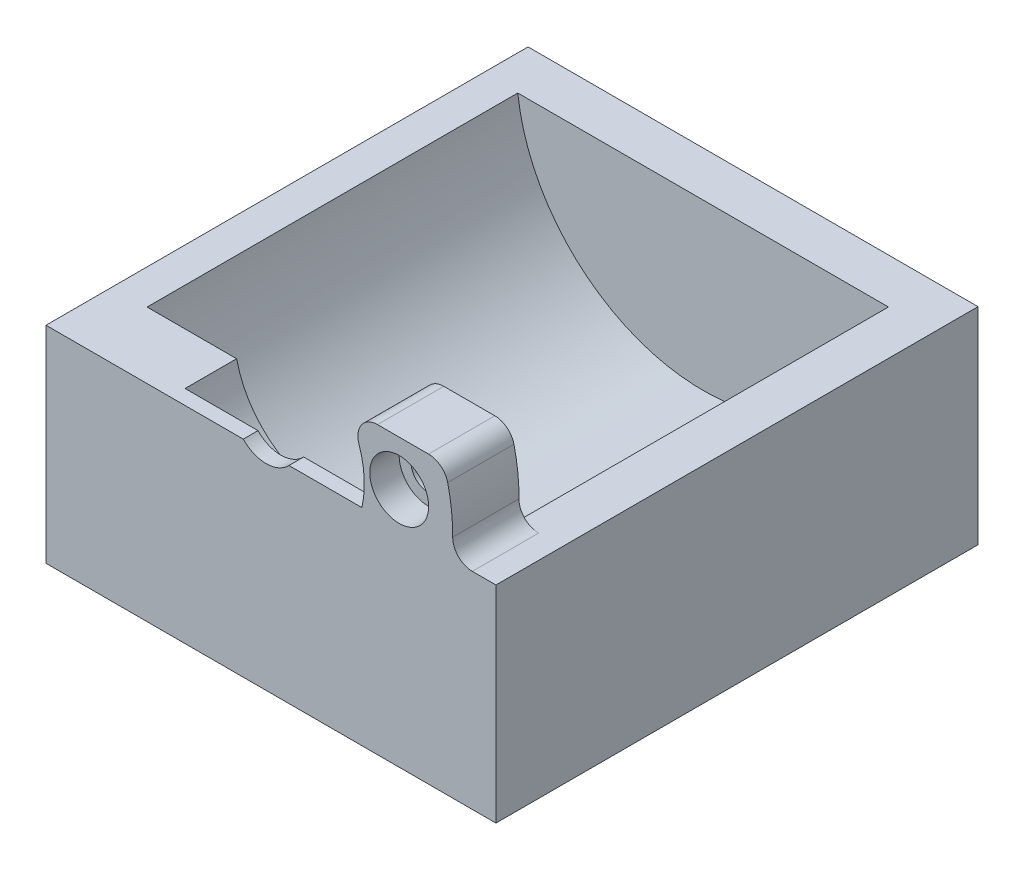
ISO-10303-21;
HEADER;
FILE_DESCRIPTION(('STEP AP214'),'2;1');
FILE_NAME('part.step','',(''),(''),'','','');
FILE_SCHEMA(('AUTOMOTIVE_DESIGN { 1 0 10303 214 1 1 1 1 }'));
ENDSEC;
DATA;
#1=APPLICATION_CONTEXT('core data for automotive mechanical design processes');
#2=APPLICATION_PROTOCOL_DEFINITION('international standard','automotive_design',2000,#1);
#3=PRODUCT_CONTEXT('',#1,'mechanical');
#4=PRODUCT('Part','Part','',(#3));
#5=PRODUCT_RELATED_PRODUCT_CATEGORY('part','',(#4));
#6=PRODUCT_DEFINITION_FORMATION('','',#4);
#7=PRODUCT_DEFINITION_CONTEXT('part definition',#1,'design');
#8=PRODUCT_DEFINITION('design','',#6,#7);
#9=PRODUCT_DEFINITION_SHAPE('','',#8);
#10=(LENGTH_UNIT() NAMED_UNIT(*) SI_UNIT(.MILLI.,.METRE.));
#11=(NAMED_UNIT(*) PLANE_ANGLE_UNIT() SI_UNIT($,.RADIAN.));
#12=(NAMED_UNIT(*) SI_UNIT($,.STERADIAN.) SOLID_ANGLE_UNIT());
#13=UNCERTAINTY_MEASURE_WITH_UNIT(LENGTH_MEASURE(1.E-05),#10,'distance_accuracy_value','');
#14=(GEOMETRIC_REPRESENTATION_CONTEXT(3) GLOBAL_UNCERTAINTY_ASSIGNED_CONTEXT((#13)) GLOBAL_UNIT_ASSIGNED_CONTEXT((#10,
#11,#12)) REPRESENTATION_CONTEXT('',''));
#15=CARTESIAN_POINT('',(0.,0.,0.));
#16=DIRECTION('',(0.,0.,1.));
#17=DIRECTION('',(1.,0.,0.));
#18=AXIS2_PLACEMENT_3D('',#15,#16,#17);
#19=CARTESIAN_POINT('',(-10.,0.,80.));
#20=DIRECTION('',(0.,0.,1.));
#21=DIRECTION('',(1.,0.,0.));
#22=AXIS2_PLACEMENT_3D('',#19,#20,#21);
#23=PLANE('',#22);
#24=DIRECTION('',(0.,-1.,0.));
#25=VECTOR('',#24,1.);
#26=CARTESIAN_POINT('',(69.7037540720334,60.4384133611691,80.));
#27=LINE('',#26,#25);
#28=CARTESIAN_POINT('',(69.7037540720334,10.4384133611691,80.));
#29=VERTEX_POINT('',#28);
#30=CARTESIAN_POINT('',(69.7037540720334,-10.5615866388309,80.));
#31=VERTEX_POINT('',#30);
#32=EDGE_CURVE('E206',#29,#31,#27,.T.);
#33=ORIENTED_EDGE('',*,*,#32,.T.);
#34=DIRECTION('',(-1.,0.,0.));
#35=VECTOR('',#34,1.);
#36=CARTESIAN_POINT('',(115.522386605031,-10.5615866388309,80.));
#37=LINE('',#36,#35);
#38=CARTESIAN_POINT('',(115.522386605031,-10.5615866388309,80.));
#39=VERTEX_POINT('',#38);
#40=EDGE_CURVE('E183',#39,#31,#37,.T.);
#41=ORIENTED_EDGE('',*,*,#40,.F.);
#42=DIRECTION('',(0.,-1.,0.));
#43=VECTOR('',#42,1.);
#44=CARTESIAN_POINT('',(115.522386605031,60.4384133611691,80.));
#45=LINE('',#44,#43);
#46=CARTESIAN_POINT('',(115.522386605031,10.4384133611691,80.));
#47=VERTEX_POINT('',#46);
#48=EDGE_CURVE('E203',#47,#39,#45,.T.);
#49=ORIENTED_EDGE('',*,*,#48,.F.);
#50=DIRECTION('',(-1.,0.,0.));
#51=VECTOR('',#50,1.);
#52=CARTESIAN_POINT('',(-92.8810020876827,10.4384133611691,80.));
#53=LINE('',#52,#51);
#54=CARTESIAN_POINT('',(113.118045509768,10.4384133611691,80.));
#55=VERTEX_POINT('',#54);
#56=EDGE_CURVE('E285',#47,#55,#53,.T.);
#57=ORIENTED_EDGE('',*,*,#56,.T.);
#58=CARTESIAN_POINT('',(113.118045509768,12.4384133611691,80.));
#59=DIRECTION('',(0.,0.,1.));
#60=DIRECTION('',(1.,0.,0.));
#61=AXIS2_PLACEMENT_3D('',#58,#59,#60);
#62=CIRCLE('',#61,2.);
#63=CARTESIAN_POINT('',(111.118136214773,12.4574609802167,80.));
#64=VERTEX_POINT('',#63);
#65=EDGE_CURVE('E329',#55,#64,#62,.F.);
#66=ORIENTED_EDGE('',*,*,#65,.T.);
#67=CARTESIAN_POINT('',(92.1189979123148,12.6384133611689,80.));
#68=DIRECTION('',(0.,0.,1.));
#69=DIRECTION('',(-1.,0.,0.));
#70=AXIS2_PLACEMENT_3D('',#67,#68,#69);
#71=CIRCLE('',#70,19.0000000000024);
#72=CARTESIAN_POINT('',(110.608046564802,17.0150650409405,80.));
#73=VERTEX_POINT('',#72);
#74=EDGE_CURVE('E227',#64,#73,#71,.T.);
#75=ORIENTED_EDGE('',*,*,#74,.T.);
#76=CARTESIAN_POINT('',(108.661830917172,16.5543648641225,80.));
#77=DIRECTION('',(0.,0.,1.));
#78=DIRECTION('',(1.,0.,0.));
#79=AXIS2_PLACEMENT_3D('',#76,#77,#78);
#80=CIRCLE('',#79,2.);
#81=CARTESIAN_POINT('',(108.661830917172,18.5543648641225,80.));
#82=VERTEX_POINT('',#81);
#83=EDGE_CURVE('E301',#73,#82,#80,.T.);
#84=ORIENTED_EDGE('',*,*,#83,.T.);
#85=DIRECTION('',(-1.,0.,0.));
#86=VECTOR('',#85,1.);
#87=CARTESIAN_POINT('',(100.181349790938,18.5543648641225,80.));
#88=LINE('',#87,#86);
#89=CARTESIAN_POINT('',(103.462071738513,18.5543648641225,80.));
#90=VERTEX_POINT('',#89);
#91=EDGE_CURVE('E223',#82,#90,#88,.T.);
#92=ORIENTED_EDGE('',*,*,#91,.T.);
#93=CARTESIAN_POINT('',(103.462071738513,16.5543648641225,80.));
#94=DIRECTION('',(0.,0.,1.));
#95=DIRECTION('',(1.,0.,0.));
#96=AXIS2_PLACEMENT_3D('',#93,#94,#95);
#97=CIRCLE('',#96,2.);
#98=CARTESIAN_POINT('',(101.571559434147,15.9017062802969,80.));
#99=VERTEX_POINT('',#98);
#100=EDGE_CURVE('E304',#90,#99,#97,.T.);
#101=ORIENTED_EDGE('',*,*,#100,.T.);
#102=CARTESIAN_POINT('',(92.1189979123168,12.638413361169,80.));
#103=DIRECTION('',(0.,0.,-1.));
#104=DIRECTION('',(-1.,0.,0.));
#105=AXIS2_PLACEMENT_3D('',#102,#103,#104);
#106=CIRCLE('',#105,10.0000000000004);
#107=CARTESIAN_POINT('',(101.873996630923,10.4384133611691,80.));
#108=VERTEX_POINT('',#107);
#109=EDGE_CURVE('E232',#99,#108,#106,.T.);
#110=ORIENTED_EDGE('',*,*,#109,.T.);
#111=CARTESIAN_POINT('',(94.4427879200417,10.4384133611691,80.));
#112=VERTEX_POINT('',#111);
#113=EDGE_CURVE('E289',#108,#112,#53,.T.);
#114=ORIENTED_EDGE('',*,*,#113,.T.);
#115=CARTESIAN_POINT('',(92.1189979123173,12.6384133611691,80.));
#116=DIRECTION('',(0.,0.,1.));
#117=DIRECTION('',(1.,0.,0.));
#118=AXIS2_PLACEMENT_3D('',#115,#116,#117);
#119=CIRCLE('',#118,3.2);
#120=CARTESIAN_POINT('',(89.7952079045928,10.4384133611691,80.));
#121=VERTEX_POINT('',#120);
#122=EDGE_CURVE('E248',#121,#112,#119,.T.);
#123=ORIENTED_EDGE('',*,*,#122,.F.);
#124=EDGE_CURVE('E284',#121,#29,#53,.T.);
#125=ORIENTED_EDGE('',*,*,#124,.T.);
#126=EDGE_LOOP('',(#33,#41,#49,#57,#66,#75,#84,#92,#101,#110,#114,#123,#125));
#127=FACE_BOUND('',#126,.T.);
#128=CARTESIAN_POINT('',(105.669337757458,13.9384133611691,80.));
#129=DIRECTION('',(0.,0.,1.));
#130=DIRECTION('',(1.,0.,0.));
#131=AXIS2_PLACEMENT_3D('',#128,#129,#130);
#132=CIRCLE('',#131,3.00000000000001);
#133=CARTESIAN_POINT('',(108.669337757458,13.9384133611691,80.));
#134=VERTEX_POINT('',#133);
#135=EDGE_CURVE('E210',#134,#134,#132,.T.);
#136=ORIENTED_EDGE('',*,*,#135,.F.);
#137=EDGE_LOOP('',(#136));
#138=FACE_BOUND('',#137,.T.);
#139=ADVANCED_FACE('F51',(#127,#138),#23,.T.);
#140=CARTESIAN_POINT('',(-92.8810020876827,10.4384133611691,80.));
#141=DIRECTION('',(0.,-1.,0.));
#142=DIRECTION('',(0.,0.,-1.));
#143=AXIS2_PLACEMENT_3D('',#140,#141,#142);
#144=PLANE('',#143);
#145=DIRECTION('',(-1.,0.,0.));
#146=VECTOR('',#145,1.);
#147=CARTESIAN_POINT('',(73.2467961329805,10.4384133611691,35.5));
#148=LINE('',#147,#146);
#149=CARTESIAN_POINT('',(110.991199691654,10.4384133611691,35.5));
#150=VERTEX_POINT('',#149);
#151=CARTESIAN_POINT('',(73.2467961329805,10.4384133611691,35.5));
#152=VERTEX_POINT('',#151);
#153=EDGE_CURVE('E345',#150,#152,#148,.T.);
#154=ORIENTED_EDGE('',*,*,#153,.F.);
#155=DIRECTION('',(0.,0.,1.));
#156=VECTOR('',#155,1.);
#157=CARTESIAN_POINT('',(110.991199691654,10.4384133611691,38.5));
#158=LINE('',#157,#156);
#159=CARTESIAN_POINT('',(110.991199691654,10.4384133611691,73.25));
#160=VERTEX_POINT('',#159);
#161=EDGE_CURVE('E281',#150,#160,#158,.T.);
#162=ORIENTED_EDGE('',*,*,#161,.T.);
#163=DIRECTION('',(1.,0.,0.));
#164=VECTOR('',#163,1.);
#165=CARTESIAN_POINT('',(92.1189979123173,10.4384133611691,73.25));
#166=LINE('',#165,#164);
#167=CARTESIAN_POINT('',(113.118045509768,10.4384133611691,73.25));
#168=VERTEX_POINT('',#167);
#169=EDGE_CURVE('E67',#160,#168,#166,.T.);
#170=ORIENTED_EDGE('',*,*,#169,.T.);
#171=DIRECTION('',(0.,0.,1.));
#172=VECTOR('',#171,1.);
#173=CARTESIAN_POINT('',(113.118045509768,10.4384133611691,80.));
#174=LINE('',#173,#172);
#175=EDGE_CURVE('E318',#168,#55,#174,.T.);
#176=ORIENTED_EDGE('',*,*,#175,.T.);
#177=ORIENTED_EDGE('',*,*,#56,.F.);
#178=DIRECTION('',(0.,0.,-1.));
#179=VECTOR('',#178,1.);
#180=CARTESIAN_POINT('',(115.522386605031,10.4384133611691,80.));
#181=LINE('',#180,#179);
#182=CARTESIAN_POINT('',(115.522386605031,10.4384133611691,30.9091006022906));
#183=VERTEX_POINT('',#182);
#184=EDGE_CURVE('E60',#47,#183,#181,.T.);
#185=ORIENTED_EDGE('',*,*,#184,.T.);
#186=DIRECTION('',(1.,0.,0.));
#187=VECTOR('',#186,1.);
#188=CARTESIAN_POINT('',(69.7037540720334,10.4384133611691,30.9091006022906));
#189=LINE('',#188,#187);
#190=CARTESIAN_POINT('',(69.7037540720334,10.4384133611691,30.9091006022906));
#191=VERTEX_POINT('',#190);
#192=EDGE_CURVE('E195',#191,#183,#189,.T.);
#193=ORIENTED_EDGE('',*,*,#192,.F.);
#194=DIRECTION('',(0.,0.,-1.));
#195=VECTOR('',#194,1.);
#196=CARTESIAN_POINT('',(69.7037540720334,10.4384133611691,80.));
#197=LINE('',#196,#195);
#198=EDGE_CURVE('E11',#29,#191,#197,.T.);
#199=ORIENTED_EDGE('',*,*,#198,.F.);
#200=ORIENTED_EDGE('',*,*,#124,.F.);
#201=DIRECTION('',(0.,0.,-1.));
#202=VECTOR('',#201,1.);
#203=CARTESIAN_POINT('',(89.7952079045928,10.4384133611691,118.5));
#204=LINE('',#203,#202);
#205=CARTESIAN_POINT('',(89.7952079045928,10.4384133611691,78.5));
#206=VERTEX_POINT('',#205);
#207=EDGE_CURVE('E256',#121,#206,#204,.T.);
#208=ORIENTED_EDGE('',*,*,#207,.T.);
#209=DIRECTION('',(1.,0.,0.));
#210=VECTOR('',#209,1.);
#211=CARTESIAN_POINT('',(-92.8810020876827,10.4384133611691,78.5));
#212=LINE('',#211,#210);
#213=CARTESIAN_POINT('',(82.3639991937115,10.4384133611691,78.5));
#214=VERTEX_POINT('',#213);
#215=EDGE_CURVE('E290',#214,#206,#212,.T.);
#216=ORIENTED_EDGE('',*,*,#215,.F.);
#217=DIRECTION('',(0.,0.,-1.));
#218=VECTOR('',#217,1.);
#219=CARTESIAN_POINT('',(82.3639991937115,10.4384133611691,78.5));
#220=LINE('',#219,#218);
#221=CARTESIAN_POINT('',(82.3639991937115,10.4384133611691,73.25));
#222=VERTEX_POINT('',#221);
#223=EDGE_CURVE('E265',#214,#222,#220,.T.);
#224=ORIENTED_EDGE('',*,*,#223,.T.);
#225=DIRECTION('',(-1.,0.,0.));
#226=VECTOR('',#225,1.);
#227=CARTESIAN_POINT('',(73.2467961329805,10.4384133611691,73.25));
#228=LINE('',#227,#226);
#229=CARTESIAN_POINT('',(73.2467961329805,10.4384133611691,73.25));
#230=VERTEX_POINT('',#229);
#231=EDGE_CURVE('E271',#222,#230,#228,.T.);
#232=ORIENTED_EDGE('',*,*,#231,.T.);
#233=DIRECTION('',(0.,0.,1.));
#234=VECTOR('',#233,1.);
#235=CARTESIAN_POINT('',(73.2467961329805,10.4384133611691,38.5));
#236=LINE('',#235,#234);
#237=EDGE_CURVE('E278',#230,#152,#236,.F.);
#238=ORIENTED_EDGE('',*,*,#237,.T.);
#239=EDGE_LOOP('',(#154,#162,#170,#176,#177,#185,#193,#199,#200,#208,#216,#224,#232,#238));
#240=FACE_BOUND('',#239,.T.);
#241=ADVANCED_FACE('F340',(#240),#144,.F.);
#242=CARTESIAN_POINT('',(105.669337757458,13.9384133611691,73.25));
#243=DIRECTION('',(0.,0.,1.));
#244=DIRECTION('',(1.,0.,0.));
#245=AXIS2_PLACEMENT_3D('',#242,#243,#244);
#246=CYLINDRICAL_SURFACE('',#245,1.79999999999999);
#247=CARTESIAN_POINT('',(105.669337757458,13.9384133611691,73.25));
#248=DIRECTION('',(0.,0.,1.));
#249=DIRECTION('',(1.,0.,0.));
#250=AXIS2_PLACEMENT_3D('',#247,#248,#249);
#251=CIRCLE('',#250,1.79999999999999);
#252=CARTESIAN_POINT('',(107.469337757458,13.9384133611691,73.25));
#253=VERTEX_POINT('',#252);
#254=EDGE_CURVE('E235',#253,#253,#251,.T.);
#255=ORIENTED_EDGE('',*,*,#254,.F.);
#256=EDGE_LOOP('',(#255));
#257=FACE_BOUND('',#256,.T.);
#258=CARTESIAN_POINT('',(105.669337757458,13.9384133611691,77.));
#259=DIRECTION('',(0.,0.,1.));
#260=DIRECTION('',(1.,0.,0.));
#261=AXIS2_PLACEMENT_3D('',#258,#259,#260);
#262=CIRCLE('',#261,1.79999999999999);
#263=CARTESIAN_POINT('',(107.469337757458,13.9384133611691,77.));
#264=VERTEX_POINT('',#263);
#265=EDGE_CURVE('E214',#264,#264,#262,.F.);
#266=ORIENTED_EDGE('',*,*,#265,.F.);
#267=EDGE_LOOP('',(#266));
#268=FACE_BOUND('',#267,.T.);
#269=ADVANCED_FACE('F419',(#257,#268),#246,.F.);
#270=CARTESIAN_POINT('',(92.1189979123173,12.6384133611691,38.5));
#271=DIRECTION('',(0.,0.,1.));
#272=DIRECTION('',(1.,0.,0.));
#273=AXIS2_PLACEMENT_3D('',#270,#271,#272);
#274=CYLINDRICAL_SURFACE('',#273,19.);
#275=CARTESIAN_POINT('',(92.1189979123173,12.6384133611691,73.25));
#276=DIRECTION('',(0.,0.,1.));
#277=DIRECTION('',(1.,0.,0.));
#278=AXIS2_PLACEMENT_3D('',#275,#276,#277);
#279=CIRCLE('',#278,19.);
#280=EDGE_CURVE('E274',#230,#160,#279,.T.);
#281=ORIENTED_EDGE('',*,*,#280,.T.);
#282=ORIENTED_EDGE('',*,*,#161,.F.);
#283=CARTESIAN_POINT('',(92.1189979123173,12.6384133611691,35.5));
#284=DIRECTION('',(0.,0.,1.));
#285=DIRECTION('',(1.,0.,0.));
#286=AXIS2_PLACEMENT_3D('',#283,#284,#285);
#287=CIRCLE('',#286,19.);
#288=EDGE_CURVE('E185',#152,#150,#287,.T.);
#289=ORIENTED_EDGE('',*,*,#288,.F.);
#290=ORIENTED_EDGE('',*,*,#237,.F.);
#291=EDGE_LOOP('',(#281,#282,#289,#290));
#292=FACE_BOUND('',#291,.T.);
#293=ADVANCED_FACE('F424',(#292),#274,.F.);
#294=CARTESIAN_POINT('',(92.1189979123173,12.6384133611691,73.25));
#295=DIRECTION('',(0.,0.,1.));
#296=DIRECTION('',(1.,0.,0.));
#297=AXIS2_PLACEMENT_3D('',#294,#295,#296);
#298=PLANE('',#297);
#299=CARTESIAN_POINT('',(92.1189979123173,12.6384133611691,73.25));
#300=DIRECTION('',(0.,0.,-1.));
#301=DIRECTION('',(-1.,0.,0.));
#302=AXIS2_PLACEMENT_3D('',#299,#300,#301);
#303=CIRCLE('',#302,9.99999999999999);
#304=CARTESIAN_POINT('',(101.571559434147,15.901706280297,73.25));
#305=VERTEX_POINT('',#304);
#306=EDGE_CURVE('E260',#305,#222,#303,.T.);
#307=ORIENTED_EDGE('',*,*,#306,.F.);
#308=CARTESIAN_POINT('',(103.462071738513,16.5543648641225,73.25));
#309=DIRECTION('',(0.,0.,1.));
#310=DIRECTION('',(1.,0.,0.));
#311=AXIS2_PLACEMENT_3D('',#308,#309,#310);
#312=CIRCLE('',#311,2.);
#313=CARTESIAN_POINT('',(103.462071738513,18.5543648641225,73.25));
#314=VERTEX_POINT('',#313);
#315=EDGE_CURVE('E313',#305,#314,#312,.F.);
#316=ORIENTED_EDGE('',*,*,#315,.T.);
#317=DIRECTION('',(-1.,0.,0.));
#318=VECTOR('',#317,1.);
#319=CARTESIAN_POINT('',(100.181349790938,18.5543648641225,73.25));
#320=LINE('',#319,#318);
#321=CARTESIAN_POINT('',(108.661830917172,18.5543648641225,73.25));
#322=VERTEX_POINT('',#321);
#323=EDGE_CURVE('E222',#322,#314,#320,.T.);
#324=ORIENTED_EDGE('',*,*,#323,.F.);
#325=CARTESIAN_POINT('',(108.661830917172,16.5543648641225,73.25));
#326=DIRECTION('',(0.,0.,1.));
#327=DIRECTION('',(1.,0.,0.));
#328=AXIS2_PLACEMENT_3D('',#325,#326,#327);
#329=CIRCLE('',#328,2.);
#330=CARTESIAN_POINT('',(110.608046564802,17.0150650409405,73.25));
#331=VERTEX_POINT('',#330);
#332=EDGE_CURVE('E310',#322,#331,#329,.F.);
#333=ORIENTED_EDGE('',*,*,#332,.T.);
#334=CARTESIAN_POINT('',(92.1189979123148,12.6384133611689,73.25));
#335=DIRECTION('',(0.,0.,1.));
#336=DIRECTION('',(-1.,0.,0.));
#337=AXIS2_PLACEMENT_3D('',#334,#335,#336);
#338=CIRCLE('',#337,19.0000000000024);
#339=CARTESIAN_POINT('',(111.118136214773,12.4574609802167,73.25));
#340=VERTEX_POINT('',#339);
#341=EDGE_CURVE('E228',#340,#331,#338,.T.);
#342=ORIENTED_EDGE('',*,*,#341,.F.);
#343=CARTESIAN_POINT('',(113.118045509768,12.4384133611691,73.25));
#344=DIRECTION('',(0.,0.,1.));
#345=DIRECTION('',(1.,0.,0.));
#346=AXIS2_PLACEMENT_3D('',#343,#344,#345);
#347=CIRCLE('',#346,2.);
#348=EDGE_CURVE('E72',#340,#168,#347,.T.);
#349=ORIENTED_EDGE('',*,*,#348,.T.);
#350=ORIENTED_EDGE('',*,*,#169,.F.);
#351=ORIENTED_EDGE('',*,*,#280,.F.);
#352=ORIENTED_EDGE('',*,*,#231,.F.);
#353=EDGE_LOOP('',(#307,#316,#324,#333,#342,#349,#350,#351,#352));
#354=FACE_BOUND('',#353,.T.);
#355=ORIENTED_EDGE('',*,*,#254,.T.);
#356=EDGE_LOOP('',(#355));
#357=FACE_BOUND('',#356,.T.);
#358=ADVANCED_FACE('F454',(#354,#357),#298,.F.);
#359=CARTESIAN_POINT('',(92.1189979123173,12.6384133611691,78.5));
#360=DIRECTION('',(0.,0.,-1.));
#361=DIRECTION('',(-1.,0.,0.));
#362=AXIS2_PLACEMENT_3D('',#359,#360,#361);
#363=PLANE('',#362);
#364=CARTESIAN_POINT('',(92.1189979123173,12.6384133611691,78.5));
#365=DIRECTION('',(0.,0.,-1.));
#366=DIRECTION('',(-1.,0.,0.));
#367=AXIS2_PLACEMENT_3D('',#364,#365,#366);
#368=CIRCLE('',#367,3.2);
#369=CARTESIAN_POINT('',(94.4427879200417,10.4384133611691,78.5));
#370=VERTEX_POINT('',#369);
#371=EDGE_CURVE('E245',#370,#206,#368,.T.);
#372=ORIENTED_EDGE('',*,*,#371,.F.);
#373=CARTESIAN_POINT('',(101.873996630923,10.4384133611691,78.5));
#374=VERTEX_POINT('',#373);
#375=EDGE_CURVE('E288',#370,#374,#212,.T.);
#376=ORIENTED_EDGE('',*,*,#375,.T.);
#377=CARTESIAN_POINT('',(92.1189979123173,12.6384133611691,78.5));
#378=DIRECTION('',(0.,0.,-1.));
#379=DIRECTION('',(-1.,0.,0.));
#380=AXIS2_PLACEMENT_3D('',#377,#378,#379);
#381=CIRCLE('',#380,9.99999999999999);
#382=EDGE_CURVE('E261',#374,#214,#381,.T.);
#383=ORIENTED_EDGE('',*,*,#382,.T.);
#384=ORIENTED_EDGE('',*,*,#215,.T.);
#385=EDGE_LOOP('',(#372,#376,#383,#384));
#386=FACE_BOUND('',#385,.T.);
#387=ADVANCED_FACE('F463',(#386),#363,.T.);
#388=CARTESIAN_POINT('',(92.1189979123173,12.6384133611691,118.5));
#389=DIRECTION('',(0.,0.,-1.));
#390=DIRECTION('',(-1.,0.,0.));
#391=AXIS2_PLACEMENT_3D('',#388,#389,#390);
#392=CYLINDRICAL_SURFACE('',#391,3.2);
#393=ORIENTED_EDGE('',*,*,#122,.T.);
#394=DIRECTION('',(0.,0.,-1.));
#395=VECTOR('',#394,1.);
#396=CARTESIAN_POINT('',(94.4427879200417,10.4384133611691,118.5));
#397=LINE('',#396,#395);
#398=EDGE_CURVE('E252',#370,#112,#397,.F.);
#399=ORIENTED_EDGE('',*,*,#398,.F.);
#400=ORIENTED_EDGE('',*,*,#371,.T.);
#401=ORIENTED_EDGE('',*,*,#207,.F.);
#402=EDGE_LOOP('',(#393,#399,#400,#401));
#403=FACE_BOUND('',#402,.T.);
#404=ADVANCED_FACE('F485',(#403),#392,.F.);
#405=ORIENTED_EDGE('',*,*,#113,.F.);
#406=DIRECTION('',(0.,0.,1.));
#407=VECTOR('',#406,1.);
#408=CARTESIAN_POINT('',(101.873996630923,10.4384133611691,73.25));
#409=LINE('',#408,#407);
#410=EDGE_CURVE('E218',#374,#108,#409,.T.);
#411=ORIENTED_EDGE('',*,*,#410,.F.);
#412=ORIENTED_EDGE('',*,*,#375,.F.);
#413=ORIENTED_EDGE('',*,*,#398,.T.);
#414=EDGE_LOOP('',(#405,#411,#412,#413));
#415=FACE_BOUND('',#414,.T.);
#416=ADVANCED_FACE('F421',(#415),#144,.F.);
#417=CARTESIAN_POINT('',(92.1189979123173,12.6384133611691,78.5));
#418=DIRECTION('',(0.,0.,-1.));
#419=DIRECTION('',(-1.,0.,0.));
#420=AXIS2_PLACEMENT_3D('',#417,#418,#419);
#421=CYLINDRICAL_SURFACE('',#420,9.99999999999999);
#422=ORIENTED_EDGE('',*,*,#109,.F.);
#423=DIRECTION('',(0.,0.,-1.));
#424=VECTOR('',#423,1.);
#425=CARTESIAN_POINT('',(101.571559434147,15.901706280297,78.5));
#426=LINE('',#425,#424);
#427=EDGE_CURVE('E307',#99,#305,#426,.T.);
#428=ORIENTED_EDGE('',*,*,#427,.T.);
#429=ORIENTED_EDGE('',*,*,#306,.T.);
#430=ORIENTED_EDGE('',*,*,#223,.F.);
#431=ORIENTED_EDGE('',*,*,#382,.F.);
#432=ORIENTED_EDGE('',*,*,#410,.T.);
#433=EDGE_LOOP('',(#422,#428,#429,#430,#431,#432));
#434=FACE_BOUND('',#433,.T.);
#435=ADVANCED_FACE('F430',(#434),#421,.F.);
#436=CARTESIAN_POINT('',(103.462071738513,16.5543648641225,78.5));
#437=DIRECTION('',(0.,0.,-1.));
#438=DIRECTION('',(-1.,0.,0.));
#439=AXIS2_PLACEMENT_3D('',#436,#437,#438);
#440=CYLINDRICAL_SURFACE('',#439,2.);
#441=ORIENTED_EDGE('',*,*,#315,.F.);
#442=ORIENTED_EDGE('',*,*,#427,.F.);
#443=ORIENTED_EDGE('',*,*,#100,.F.);
#444=DIRECTION('',(0.,0.,1.));
#445=VECTOR('',#444,1.);
#446=CARTESIAN_POINT('',(103.462071738513,18.5543648641225,80.));
#447=LINE('',#446,#445);
#448=EDGE_CURVE('E297',#314,#90,#447,.T.);
#449=ORIENTED_EDGE('',*,*,#448,.F.);
#450=EDGE_LOOP('',(#441,#442,#443,#449));
#451=FACE_BOUND('',#450,.T.);
#452=ADVANCED_FACE('F427',(#451),#440,.T.);
#453=CARTESIAN_POINT('',(100.181349790938,18.5543648641225,73.25));
#454=DIRECTION('',(0.,1.,0.));
#455=DIRECTION('',(0.,0.,1.));
#456=AXIS2_PLACEMENT_3D('',#453,#454,#455);
#457=PLANE('',#456);
#458=ORIENTED_EDGE('',*,*,#323,.T.);
#459=ORIENTED_EDGE('',*,*,#448,.T.);
#460=ORIENTED_EDGE('',*,*,#91,.F.);
#461=DIRECTION('',(0.,0.,1.));
#462=VECTOR('',#461,1.);
#463=CARTESIAN_POINT('',(108.661830917172,18.5543648641225,73.25));
#464=LINE('',#463,#462);
#465=EDGE_CURVE('E294',#82,#322,#464,.F.);
#466=ORIENTED_EDGE('',*,*,#465,.T.);
#467=EDGE_LOOP('',(#458,#459,#460,#466));
#468=FACE_BOUND('',#467,.T.);
#469=ADVANCED_FACE('F429',(#468),#457,.T.);
#470=CARTESIAN_POINT('',(108.661830917172,16.5543648641225,73.25));
#471=DIRECTION('',(0.,0.,1.));
#472=DIRECTION('',(1.,0.,0.));
#473=AXIS2_PLACEMENT_3D('',#470,#471,#472);
#474=CYLINDRICAL_SURFACE('',#473,2.);
#475=ORIENTED_EDGE('',*,*,#332,.F.);
#476=ORIENTED_EDGE('',*,*,#465,.F.);
#477=ORIENTED_EDGE('',*,*,#83,.F.);
#478=DIRECTION('',(0.,0.,1.));
#479=VECTOR('',#478,1.);
#480=CARTESIAN_POINT('',(110.608046564802,17.0150650409405,73.25));
#481=LINE('',#480,#479);
#482=EDGE_CURVE('E322',#331,#73,#481,.T.);
#483=ORIENTED_EDGE('',*,*,#482,.F.);
#484=EDGE_LOOP('',(#475,#476,#477,#483));
#485=FACE_BOUND('',#484,.T.);
#486=ADVANCED_FACE('F53',(#485),#474,.T.);
#487=CARTESIAN_POINT('',(92.1189979123148,12.6384133611689,73.25));
#488=DIRECTION('',(0.,0.,1.));
#489=DIRECTION('',(1.,0.,0.));
#490=AXIS2_PLACEMENT_3D('',#487,#488,#489);
#491=CYLINDRICAL_SURFACE('',#490,19.0000000000024);
#492=ORIENTED_EDGE('',*,*,#74,.F.);
#493=DIRECTION('',(0.,0.,1.));
#494=VECTOR('',#493,1.);
#495=CARTESIAN_POINT('',(111.118136214773,12.4574609802167,73.25));
#496=LINE('',#495,#494);
#497=EDGE_CURVE('E326',#64,#340,#496,.F.);
#498=ORIENTED_EDGE('',*,*,#497,.T.);
#499=ORIENTED_EDGE('',*,*,#341,.T.);
#500=ORIENTED_EDGE('',*,*,#482,.T.);
#501=EDGE_LOOP('',(#492,#498,#499,#500));
#502=FACE_BOUND('',#501,.T.);
#503=ADVANCED_FACE('F435',(#502),#491,.T.);
#504=CARTESIAN_POINT('',(113.118045509768,12.4384133611691,73.25));
#505=DIRECTION('',(0.,0.,1.));
#506=DIRECTION('',(1.,0.,0.));
#507=AXIS2_PLACEMENT_3D('',#504,#505,#506);
#508=CYLINDRICAL_SURFACE('',#507,2.);
#509=ORIENTED_EDGE('',*,*,#348,.F.);
#510=ORIENTED_EDGE('',*,*,#497,.F.);
#511=ORIENTED_EDGE('',*,*,#65,.F.);
#512=ORIENTED_EDGE('',*,*,#175,.F.);
#513=EDGE_LOOP('',(#509,#510,#511,#512));
#514=FACE_BOUND('',#513,.T.);
#515=ADVANCED_FACE('F432',(#514),#508,.F.);
#516=CARTESIAN_POINT('',(105.669337757458,13.9384133611691,77.));
#517=DIRECTION('',(0.,0.,1.));
#518=DIRECTION('',(1.,0.,0.));
#519=AXIS2_PLACEMENT_3D('',#516,#517,#518);
#520=PLANE('',#519);
#521=CARTESIAN_POINT('',(105.669337757458,13.9384133611691,77.));
#522=DIRECTION('',(0.,0.,1.));
#523=DIRECTION('',(1.,0.,0.));
#524=AXIS2_PLACEMENT_3D('',#521,#522,#523);
#525=CIRCLE('',#524,3.00000000000001);
#526=CARTESIAN_POINT('',(108.669337757458,13.9384133611691,77.));
#527=VERTEX_POINT('',#526);
#528=EDGE_CURVE('E209',#527,#527,#525,.T.);
#529=ORIENTED_EDGE('',*,*,#528,.T.);
#530=EDGE_LOOP('',(#529));
#531=FACE_BOUND('',#530,.T.);
#532=ORIENTED_EDGE('',*,*,#265,.T.);
#533=EDGE_LOOP('',(#532));
#534=FACE_BOUND('',#533,.T.);
#535=ADVANCED_FACE('F434',(#531,#534),#520,.T.);
#536=CARTESIAN_POINT('',(105.669337757458,13.9384133611691,77.));
#537=DIRECTION('',(0.,0.,1.));
#538=DIRECTION('',(1.,0.,0.));
#539=AXIS2_PLACEMENT_3D('',#536,#537,#538);
#540=CYLINDRICAL_SURFACE('',#539,3.00000000000001);
#541=ORIENTED_EDGE('',*,*,#528,.F.);
#542=EDGE_LOOP('',(#541));
#543=FACE_BOUND('',#542,.T.);
#544=ORIENTED_EDGE('',*,*,#135,.T.);
#545=EDGE_LOOP('',(#544));
#546=FACE_BOUND('',#545,.T.);
#547=ADVANCED_FACE('F441',(#543,#546),#540,.F.);
#548=CARTESIAN_POINT('',(69.7037540720334,60.4384133611691,0.));
#549=DIRECTION('',(-1.,0.,0.));
#550=DIRECTION('',(0.,0.,1.));
#551=AXIS2_PLACEMENT_3D('',#548,#549,#550);
#552=PLANE('',#551);
#553=DIRECTION('',(0.,1.,0.));
#554=VECTOR('',#553,1.);
#555=CARTESIAN_POINT('',(69.7037540720334,3.43841336116911,30.9091006022906));
#556=LINE('',#555,#554);
#557=CARTESIAN_POINT('',(69.7037540720334,-10.5615866388309,30.9091006022906));
#558=VERTEX_POINT('',#557);
#559=EDGE_CURVE('E164',#558,#191,#556,.T.);
#560=ORIENTED_EDGE('',*,*,#559,.F.);
#561=DIRECTION('',(0.,0.,1.));
#562=VECTOR('',#561,1.);
#563=CARTESIAN_POINT('',(69.7037540720334,-10.5615866388309,0.));
#564=LINE('',#563,#562);
#565=EDGE_CURVE('E167',#558,#31,#564,.T.);
#566=ORIENTED_EDGE('',*,*,#565,.T.);
#567=ORIENTED_EDGE('',*,*,#32,.F.);
#568=ORIENTED_EDGE('',*,*,#198,.T.);
#569=EDGE_LOOP('',(#560,#566,#567,#568));
#570=FACE_BOUND('',#569,.T.);
#571=ADVANCED_FACE('F166',(#570),#552,.T.);
#572=CARTESIAN_POINT('',(115.522386605031,60.4384133611691,0.));
#573=DIRECTION('',(-1.,0.,0.));
#574=DIRECTION('',(0.,0.,1.));
#575=AXIS2_PLACEMENT_3D('',#572,#573,#574);
#576=PLANE('',#575);
#577=DIRECTION('',(0.,0.,1.));
#578=VECTOR('',#577,1.);
#579=CARTESIAN_POINT('',(115.522386605031,-10.5615866388309,34.9091006022906));
#580=LINE('',#579,#578);
#581=CARTESIAN_POINT('',(115.522386605031,-10.5615866388309,30.9091006022906));
#582=VERTEX_POINT('',#581);
#583=EDGE_CURVE('E175',#582,#39,#580,.T.);
#584=ORIENTED_EDGE('',*,*,#583,.F.);
#585=DIRECTION('',(0.,-1.,0.));
#586=VECTOR('',#585,1.);
#587=CARTESIAN_POINT('',(115.522386605031,10.4384133611691,30.9091006022906));
#588=LINE('',#587,#586);
#589=EDGE_CURVE('E191',#183,#582,#588,.T.);
#590=ORIENTED_EDGE('',*,*,#589,.F.);
#591=ORIENTED_EDGE('',*,*,#184,.F.);
#592=ORIENTED_EDGE('',*,*,#48,.T.);
#593=EDGE_LOOP('',(#584,#590,#591,#592));
#594=FACE_BOUND('',#593,.T.);
#595=ADVANCED_FACE('F343',(#594),#576,.F.);
#596=CARTESIAN_POINT('',(0.,-10.5615866388309,0.));
#597=DIRECTION('',(0.,-1.,0.));
#598=DIRECTION('',(0.,0.,-1.));
#599=AXIS2_PLACEMENT_3D('',#596,#597,#598);
#600=PLANE('',#599);
#601=CARTESIAN_POINT('',(80.2137540720337,-10.5615866388309,43.05));
#602=DIRECTION('',(0.,-1.,0.));
#603=DIRECTION('',(0.,0.,-1.));
#604=AXIS2_PLACEMENT_3D('',#601,#602,#603);
#605=CIRCLE('',#604,3.15);
#606=CARTESIAN_POINT('',(80.2137540720337,-10.5615866388309,39.9));
#607=VERTEX_POINT('',#606);
#608=EDGE_CURVE('E373',#607,#607,#605,.T.);
#609=ORIENTED_EDGE('',*,*,#608,.F.);
#610=EDGE_LOOP('',(#609));
#611=FACE_BOUND('',#610,.T.);
#612=CARTESIAN_POINT('',(105.013754072034,-10.5615866388309,43.05));
#613=DIRECTION('',(0.,-1.,0.));
#614=DIRECTION('',(0.,0.,-1.));
#615=AXIS2_PLACEMENT_3D('',#612,#613,#614);
#616=CIRCLE('',#615,3.15);
#617=CARTESIAN_POINT('',(105.013754072034,-10.5615866388309,39.9));
#618=VERTEX_POINT('',#617);
#619=EDGE_CURVE('E365',#618,#618,#616,.T.);
#620=ORIENTED_EDGE('',*,*,#619,.F.);
#621=EDGE_LOOP('',(#620));
#622=FACE_BOUND('',#621,.T.);
#623=CARTESIAN_POINT('',(105.013754072033,-10.5615866388309,67.85));
#624=DIRECTION('',(0.,-1.,0.));
#625=DIRECTION('',(0.,0.,-1.));
#626=AXIS2_PLACEMENT_3D('',#623,#624,#625);
#627=CIRCLE('',#626,3.15);
#628=CARTESIAN_POINT('',(105.013754072033,-10.5615866388309,64.7));
#629=VERTEX_POINT('',#628);
#630=EDGE_CURVE('E357',#629,#629,#627,.T.);
#631=ORIENTED_EDGE('',*,*,#630,.F.);
#632=EDGE_LOOP('',(#631));
#633=FACE_BOUND('',#632,.T.);
#634=CARTESIAN_POINT('',(80.2137540720334,-10.5615866388309,67.85));
#635=DIRECTION('',(0.,-1.,0.));
#636=DIRECTION('',(0.,0.,-1.));
#637=AXIS2_PLACEMENT_3D('',#634,#635,#636);
#638=CIRCLE('',#637,3.15);
#639=CARTESIAN_POINT('',(80.2137540720334,-10.5615866388309,64.7));
#640=VERTEX_POINT('',#639);
#641=EDGE_CURVE('E353',#640,#640,#638,.T.);
#642=ORIENTED_EDGE('',*,*,#641,.F.);
#643=EDGE_LOOP('',(#642));
#644=FACE_BOUND('',#643,.T.);
#645=ORIENTED_EDGE('',*,*,#565,.F.);
#646=DIRECTION('',(-1.,0.,0.));
#647=VECTOR('',#646,1.);
#648=CARTESIAN_POINT('',(115.522386605031,-10.5615866388309,30.9091006022906));
#649=LINE('',#648,#647);
#650=EDGE_CURVE('E176',#582,#558,#649,.T.);
#651=ORIENTED_EDGE('',*,*,#650,.F.);
#652=ORIENTED_EDGE('',*,*,#583,.T.);
#653=ORIENTED_EDGE('',*,*,#40,.T.);
#654=EDGE_LOOP('',(#645,#651,#652,#653));
#655=FACE_BOUND('',#654,.T.);
#656=ADVANCED_FACE('F180',(#611,#622,#633,#644,#655),#600,.T.);
#657=CARTESIAN_POINT('',(0.,0.,30.9091006022906));
#658=DIRECTION('',(0.,0.,-1.));
#659=DIRECTION('',(-1.,0.,0.));
#660=AXIS2_PLACEMENT_3D('',#657,#658,#659);
#661=PLANE('',#660);
#662=ORIENTED_EDGE('',*,*,#650,.T.);
#663=ORIENTED_EDGE('',*,*,#559,.T.);
#664=ORIENTED_EDGE('',*,*,#192,.T.);
#665=ORIENTED_EDGE('',*,*,#589,.T.);
#666=EDGE_LOOP('',(#662,#663,#664,#665));
#667=FACE_BOUND('',#666,.T.);
#668=ADVANCED_FACE('F189',(#667),#661,.T.);
#669=CARTESIAN_POINT('',(92.1189979123173,12.6384133611691,35.5));
#670=DIRECTION('',(0.,0.,1.));
#671=DIRECTION('',(1.,0.,0.));
#672=AXIS2_PLACEMENT_3D('',#669,#670,#671);
#673=PLANE('',#672);
#674=ORIENTED_EDGE('',*,*,#288,.T.);
#675=ORIENTED_EDGE('',*,*,#153,.T.);
#676=EDGE_LOOP('',(#674,#675));
#677=FACE_BOUND('',#676,.T.);
#678=ADVANCED_FACE('F399',(#677),#673,.T.);
#679=CARTESIAN_POINT('',(80.2137540720334,-17.5615866388309,67.85));
#680=DIRECTION('',(0.,1.,0.));
#681=DIRECTION('',(0.,0.,1.));
#682=AXIS2_PLACEMENT_3D('',#679,#680,#681);
#683=CYLINDRICAL_SURFACE('',#682,3.15);
#684=CARTESIAN_POINT('',(80.2137540720334,-17.5615866388309,67.85));
#685=DIRECTION('',(0.,-1.,0.));
#686=DIRECTION('',(0.,0.,-1.));
#687=AXIS2_PLACEMENT_3D('',#684,#685,#686);
#688=CIRCLE('',#687,3.15);
#689=CARTESIAN_POINT('',(80.2137540720334,-17.5615866388309,64.7));
#690=VERTEX_POINT('',#689);
#691=EDGE_CURVE('E186',#690,#690,#688,.T.);
#692=ORIENTED_EDGE('',*,*,#691,.F.);
#693=EDGE_LOOP('',(#692));
#694=FACE_BOUND('',#693,.T.);
#695=ORIENTED_EDGE('',*,*,#641,.T.);
#696=EDGE_LOOP('',(#695));
#697=FACE_BOUND('',#696,.T.);
#698=ADVANCED_FACE('F396',(#694,#697),#683,.T.);
#699=CARTESIAN_POINT('',(80.2137540720334,-17.5615866388309,67.85));
#700=DIRECTION('',(0.,-1.,0.));
#701=DIRECTION('',(0.,0.,-1.));
#702=AXIS2_PLACEMENT_3D('',#699,#700,#701);
#703=PLANE('',#702);
#704=ORIENTED_EDGE('',*,*,#691,.T.);
#705=EDGE_LOOP('',(#704));
#706=FACE_BOUND('',#705,.T.);
#707=ADVANCED_FACE('F398',(#706),#703,.T.);
#708=CARTESIAN_POINT('',(105.013754072033,-17.5615866388309,67.85));
#709=DIRECTION('',(0.,1.,0.));
#710=DIRECTION('',(0.,0.,1.));
#711=AXIS2_PLACEMENT_3D('',#708,#709,#710);
#712=CYLINDRICAL_SURFACE('',#711,3.15);
#713=CARTESIAN_POINT('',(105.013754072033,-17.5615866388309,67.85));
#714=DIRECTION('',(0.,-1.,0.));
#715=DIRECTION('',(0.,0.,-1.));
#716=AXIS2_PLACEMENT_3D('',#713,#714,#715);
#717=CIRCLE('',#716,3.15);
#718=CARTESIAN_POINT('',(105.013754072033,-17.5615866388309,64.7));
#719=VERTEX_POINT('',#718);
#720=EDGE_CURVE('E361',#719,#719,#717,.T.);
#721=ORIENTED_EDGE('',*,*,#720,.F.);
#722=EDGE_LOOP('',(#721));
#723=FACE_BOUND('',#722,.T.);
#724=ORIENTED_EDGE('',*,*,#630,.T.);
#725=EDGE_LOOP('',(#724));
#726=FACE_BOUND('',#725,.T.);
#727=ADVANCED_FACE('F405',(#723,#726),#712,.T.);
#728=CARTESIAN_POINT('',(105.013754072033,-17.5615866388309,67.85));
#729=DIRECTION('',(0.,-1.,0.));
#730=DIRECTION('',(0.,0.,-1.));
#731=AXIS2_PLACEMENT_3D('',#728,#729,#730);
#732=PLANE('',#731);
#733=ORIENTED_EDGE('',*,*,#720,.T.);
#734=EDGE_LOOP('',(#733));
#735=FACE_BOUND('',#734,.T.);
#736=ADVANCED_FACE('F620',(#735),#732,.T.);
#737=CARTESIAN_POINT('',(105.013754072034,-17.5615866388309,43.05));
#738=DIRECTION('',(0.,1.,0.));
#739=DIRECTION('',(0.,0.,1.));
#740=AXIS2_PLACEMENT_3D('',#737,#738,#739);
#741=CYLINDRICAL_SURFACE('',#740,3.15);
#742=CARTESIAN_POINT('',(105.013754072034,-17.5615866388309,43.05));
#743=DIRECTION('',(0.,-1.,0.));
#744=DIRECTION('',(0.,0.,-1.));
#745=AXIS2_PLACEMENT_3D('',#742,#743,#744);
#746=CIRCLE('',#745,3.15);
#747=CARTESIAN_POINT('',(105.013754072034,-17.5615866388309,39.9));
#748=VERTEX_POINT('',#747);
#749=EDGE_CURVE('E369',#748,#748,#746,.T.);
#750=ORIENTED_EDGE('',*,*,#749,.F.);
#751=EDGE_LOOP('',(#750));
#752=FACE_BOUND('',#751,.T.);
#753=ORIENTED_EDGE('',*,*,#619,.T.);
#754=EDGE_LOOP('',(#753));
#755=FACE_BOUND('',#754,.T.);
#756=ADVANCED_FACE('F629',(#752,#755),#741,.T.);
#757=CARTESIAN_POINT('',(105.013754072034,-17.5615866388309,43.05));
#758=DIRECTION('',(0.,-1.,0.));
#759=DIRECTION('',(0.,0.,-1.));
#760=AXIS2_PLACEMENT_3D('',#757,#758,#759);
#761=PLANE('',#760);
#762=ORIENTED_EDGE('',*,*,#749,.T.);
#763=EDGE_LOOP('',(#762));
#764=FACE_BOUND('',#763,.T.);
#765=ADVANCED_FACE('F638',(#764),#761,.T.);
#766=CARTESIAN_POINT('',(80.2137540720337,-17.5615866388309,43.05));
#767=DIRECTION('',(0.,1.,0.));
#768=DIRECTION('',(0.,0.,1.));
#769=AXIS2_PLACEMENT_3D('',#766,#767,#768);
#770=CYLINDRICAL_SURFACE('',#769,3.15);
#771=CARTESIAN_POINT('',(80.2137540720337,-17.5615866388309,43.05));
#772=DIRECTION('',(0.,-1.,0.));
#773=DIRECTION('',(0.,0.,-1.));
#774=AXIS2_PLACEMENT_3D('',#771,#772,#773);
#775=CIRCLE('',#774,3.15);
#776=CARTESIAN_POINT('',(80.2137540720337,-17.5615866388309,39.9));
#777=VERTEX_POINT('',#776);
#778=EDGE_CURVE('E377',#777,#777,#775,.T.);
#779=ORIENTED_EDGE('',*,*,#778,.F.);
#780=EDGE_LOOP('',(#779));
#781=FACE_BOUND('',#780,.T.);
#782=ORIENTED_EDGE('',*,*,#608,.T.);
#783=EDGE_LOOP('',(#782));
#784=FACE_BOUND('',#783,.T.);
#785=ADVANCED_FACE('F385',(#781,#784),#770,.T.);
#786=CARTESIAN_POINT('',(80.2137540720337,-17.5615866388309,43.05));
#787=DIRECTION('',(0.,-1.,0.));
#788=DIRECTION('',(0.,0.,-1.));
#789=AXIS2_PLACEMENT_3D('',#786,#787,#788);
#790=PLANE('',#789);
#791=ORIENTED_EDGE('',*,*,#778,.T.);
#792=EDGE_LOOP('',(#791));
#793=FACE_BOUND('',#792,.T.);
#794=ADVANCED_FACE('F655',(#793),#790,.T.);
#795=CLOSED_SHELL('',(#139,#241,#269,#293,#358,#387,#404,#416,#435,#452,#469,#486,#503,#515,
#535,#547,#571,#595,#656,#668,#678,#698,#707,#727,#736,#756,#765,#785,#794));
#796=MANIFOLD_SOLID_BREP('B2',#795);
#797=ADVANCED_BREP_SHAPE_REPRESENTATION('',(#18,#796),#14);
#798=SHAPE_DEFINITION_REPRESENTATION(#9,#797);
ENDSEC;
END-ISO-10303-21;
